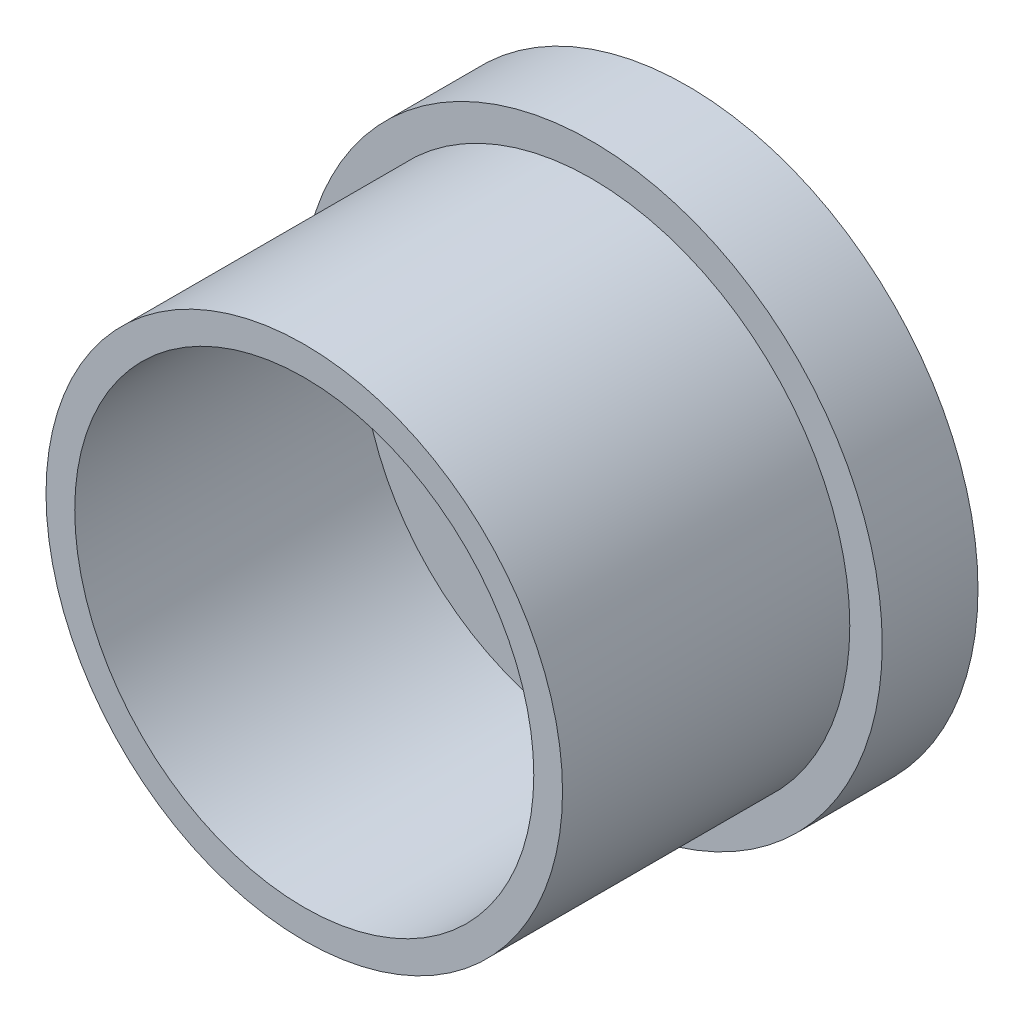
ISO-10303-21;
HEADER;
FILE_DESCRIPTION(('STEP AP214'),'2;1');
FILE_NAME('part.step','',(''),(''),'','','');
FILE_SCHEMA(('AUTOMOTIVE_DESIGN { 1 0 10303 214 1 1 1 1 }'));
ENDSEC;
DATA;
#1=APPLICATION_CONTEXT('core data for automotive mechanical design processes');
#2=APPLICATION_PROTOCOL_DEFINITION('international standard','automotive_design',2000,#1);
#3=PRODUCT_CONTEXT('',#1,'mechanical');
#4=PRODUCT('Part','Part','',(#3));
#5=PRODUCT_RELATED_PRODUCT_CATEGORY('part','',(#4));
#6=PRODUCT_DEFINITION_FORMATION('','',#4);
#7=PRODUCT_DEFINITION_CONTEXT('part definition',#1,'design');
#8=PRODUCT_DEFINITION('design','',#6,#7);
#9=PRODUCT_DEFINITION_SHAPE('','',#8);
#10=(LENGTH_UNIT() NAMED_UNIT(*) SI_UNIT(.MILLI.,.METRE.));
#11=(NAMED_UNIT(*) PLANE_ANGLE_UNIT() SI_UNIT($,.RADIAN.));
#12=(NAMED_UNIT(*) SI_UNIT($,.STERADIAN.) SOLID_ANGLE_UNIT());
#13=UNCERTAINTY_MEASURE_WITH_UNIT(LENGTH_MEASURE(1.E-05),#10,'distance_accuracy_value','');
#14=(GEOMETRIC_REPRESENTATION_CONTEXT(3) GLOBAL_UNCERTAINTY_ASSIGNED_CONTEXT((#13)) GLOBAL_UNIT_ASSIGNED_CONTEXT((#10,
#11,#12)) REPRESENTATION_CONTEXT('',''));
#15=CARTESIAN_POINT('',(0.,0.,0.));
#16=DIRECTION('',(0.,0.,1.));
#17=DIRECTION('',(1.,0.,0.));
#18=AXIS2_PLACEMENT_3D('',#15,#16,#17);
#19=CARTESIAN_POINT('',(0.,0.,10.));
#20=DIRECTION('',(0.,0.,1.));
#21=DIRECTION('',(1.,0.,0.));
#22=AXIS2_PLACEMENT_3D('',#19,#20,#21);
#23=PLANE('',#22);
#24=CARTESIAN_POINT('',(-10.5,10.5,10.));
#25=DIRECTION('',(0.,0.,1.));
#26=DIRECTION('',(1.,0.,0.));
#27=AXIS2_PLACEMENT_3D('',#24,#25,#26);
#28=CIRCLE('',#27,8.81972391336754);
#29=CARTESIAN_POINT('',(-10.5,1.68027608663247,10.));
#30=VERTEX_POINT('',#29);
#31=CARTESIAN_POINT('',(-10.5,19.3197239133675,10.));
#32=VERTEX_POINT('',#31);
#33=EDGE_CURVE('E205',#30,#32,#28,.T.);
#34=ORIENTED_EDGE('',*,*,#33,.F.);
#35=DIRECTION('',(1.,0.,0.));
#36=VECTOR('',#35,1.);
#37=CARTESIAN_POINT('',(0.,1.68027608663247,10.));
#38=LINE('',#37,#36);
#39=CARTESIAN_POINT('',(-16.75,1.68027608663247,10.));
#40=VERTEX_POINT('',#39);
#41=EDGE_CURVE('E229',#40,#30,#38,.T.);
#42=ORIENTED_EDGE('',*,*,#41,.F.);
#43=DIRECTION('',(0.,1.,0.));
#44=VECTOR('',#43,1.);
#45=CARTESIAN_POINT('',(-16.75,0.,10.));
#46=LINE('',#45,#44);
#47=CARTESIAN_POINT('',(-16.75,0.,10.));
#48=VERTEX_POINT('',#47);
#49=EDGE_CURVE('E238',#48,#40,#46,.T.);
#50=ORIENTED_EDGE('',*,*,#49,.F.);
#51=DIRECTION('',(1.,0.,0.));
#52=VECTOR('',#51,1.);
#53=CARTESIAN_POINT('',(0.,0.,10.));
#54=LINE('',#53,#52);
#55=CARTESIAN_POINT('',(-28.75,0.,10.));
#56=VERTEX_POINT('',#55);
#57=EDGE_CURVE('E242',#56,#48,#54,.T.);
#58=ORIENTED_EDGE('',*,*,#57,.F.);
#59=DIRECTION('',(0.,1.,0.));
#60=VECTOR('',#59,1.);
#61=CARTESIAN_POINT('',(-28.75,0.,10.));
#62=LINE('',#61,#60);
#63=CARTESIAN_POINT('',(-28.75,1.68027608663246,10.));
#64=VERTEX_POINT('',#63);
#65=EDGE_CURVE('E246',#56,#64,#62,.T.);
#66=ORIENTED_EDGE('',*,*,#65,.T.);
#67=CARTESIAN_POINT('',(-35.,1.68027608663246,10.));
#68=VERTEX_POINT('',#67);
#69=EDGE_CURVE('E248',#68,#64,#38,.T.);
#70=ORIENTED_EDGE('',*,*,#69,.F.);
#71=CARTESIAN_POINT('',(-35.,10.5,10.));
#72=DIRECTION('',(0.,0.,1.));
#73=DIRECTION('',(1.,0.,0.));
#74=AXIS2_PLACEMENT_3D('',#71,#72,#73);
#75=CIRCLE('',#74,8.81972391336754);
#76=CARTESIAN_POINT('',(-35.,19.3197239133675,10.));
#77=VERTEX_POINT('',#76);
#78=EDGE_CURVE('E252',#77,#68,#75,.T.);
#79=ORIENTED_EDGE('',*,*,#78,.F.);
#80=DIRECTION('',(1.,0.,0.));
#81=VECTOR('',#80,1.);
#82=CARTESIAN_POINT('',(0.,19.3197239133676,10.));
#83=LINE('',#82,#81);
#84=CARTESIAN_POINT('',(-28.3781314851122,19.3197239133675,10.));
#85=VERTEX_POINT('',#84);
#86=EDGE_CURVE('E168',#77,#85,#83,.T.);
#87=ORIENTED_EDGE('',*,*,#86,.T.);
#88=DIRECTION('',(0.,-1.,0.));
#89=VECTOR('',#88,1.);
#90=CARTESIAN_POINT('',(-28.3781314851122,0.,10.));
#91=LINE('',#90,#89);
#92=CARTESIAN_POINT('',(-28.3781314851122,21.,10.));
#93=VERTEX_POINT('',#92);
#94=EDGE_CURVE('E154',#93,#85,#91,.T.);
#95=ORIENTED_EDGE('',*,*,#94,.F.);
#96=DIRECTION('',(1.,0.,0.));
#97=VECTOR('',#96,1.);
#98=CARTESIAN_POINT('',(0.,21.,10.));
#99=LINE('',#98,#97);
#100=CARTESIAN_POINT('',(-17.074172485353,21.,10.));
#101=VERTEX_POINT('',#100);
#102=EDGE_CURVE('E148',#93,#101,#99,.T.);
#103=ORIENTED_EDGE('',*,*,#102,.T.);
#104=DIRECTION('',(0.,-1.,0.));
#105=VECTOR('',#104,1.);
#106=CARTESIAN_POINT('',(-17.074172485353,0.,10.));
#107=LINE('',#106,#105);
#108=CARTESIAN_POINT('',(-17.074172485353,19.3197239133675,10.));
#109=VERTEX_POINT('',#108);
#110=EDGE_CURVE('E152',#101,#109,#107,.T.);
#111=ORIENTED_EDGE('',*,*,#110,.T.);
#112=EDGE_CURVE('E69',#109,#32,#83,.T.);
#113=ORIENTED_EDGE('',*,*,#112,.T.);
#114=EDGE_LOOP('',(#34,#42,#50,#58,#66,#70,#79,#87,#95,#103,#111,#113));
#115=FACE_BOUND('',#114,.T.);
#116=CARTESIAN_POINT('',(-22.75,10.5,10.));
#117=DIRECTION('',(0.,0.,1.));
#118=DIRECTION('',(1.,0.,0.));
#119=AXIS2_PLACEMENT_3D('',#116,#117,#118);
#120=CIRCLE('',#119,23.9699774785851);
#121=CARTESIAN_POINT('',(1.21997747858509,10.5,10.));
#122=VERTEX_POINT('',#121);
#123=EDGE_CURVE('E266',#122,#122,#120,.T.);
#124=ORIENTED_EDGE('',*,*,#123,.T.);
#125=EDGE_LOOP('',(#124));
#126=FACE_BOUND('',#125,.T.);
#127=ADVANCED_FACE('F51',(#115,#126),#23,.T.);
#128=CARTESIAN_POINT('',(-10.5,10.5,10.));
#129=DIRECTION('',(0.,0.,-1.));
#130=DIRECTION('',(-1.,0.,0.));
#131=AXIS2_PLACEMENT_3D('',#128,#129,#130);
#132=CYLINDRICAL_SURFACE('',#131,8.81972391336754);
#133=CARTESIAN_POINT('',(-10.5,10.5,0.));
#134=DIRECTION('',(0.,0.,1.));
#135=DIRECTION('',(1.,0.,0.));
#136=AXIS2_PLACEMENT_3D('',#133,#134,#135);
#137=CIRCLE('',#136,8.81972391336754);
#138=CARTESIAN_POINT('',(-10.5,1.68027608663247,0.));
#139=VERTEX_POINT('',#138);
#140=CARTESIAN_POINT('',(-10.5,19.3197239133675,0.));
#141=VERTEX_POINT('',#140);
#142=EDGE_CURVE('E173',#139,#141,#137,.T.);
#143=ORIENTED_EDGE('',*,*,#142,.F.);
#144=DIRECTION('',(0.,0.,-1.));
#145=VECTOR('',#144,1.);
#146=CARTESIAN_POINT('',(-10.5,1.68027608663247,10.));
#147=LINE('',#146,#145);
#148=EDGE_CURVE('E55',#30,#139,#147,.T.);
#149=ORIENTED_EDGE('',*,*,#148,.F.);
#150=ORIENTED_EDGE('',*,*,#33,.T.);
#151=DIRECTION('',(0.,0.,-1.));
#152=VECTOR('',#151,1.);
#153=CARTESIAN_POINT('',(-10.5,19.3197239133675,10.));
#154=LINE('',#153,#152);
#155=EDGE_CURVE('E117',#32,#141,#154,.T.);
#156=ORIENTED_EDGE('',*,*,#155,.T.);
#157=EDGE_LOOP('',(#143,#149,#150,#156));
#158=FACE_BOUND('',#157,.T.);
#159=ADVANCED_FACE('F53',(#158),#132,.F.);
#160=CARTESIAN_POINT('',(0.,1.68027608663247,10.));
#161=DIRECTION('',(0.,1.,0.));
#162=DIRECTION('',(-1.,0.,0.));
#163=AXIS2_PLACEMENT_3D('',#160,#161,#162);
#164=PLANE('',#163);
#165=DIRECTION('',(1.,0.,0.));
#166=VECTOR('',#165,1.);
#167=CARTESIAN_POINT('',(0.,1.68027608663247,0.));
#168=LINE('',#167,#166);
#169=CARTESIAN_POINT('',(-16.75,1.68027608663247,0.));
#170=VERTEX_POINT('',#169);
#171=EDGE_CURVE('E176',#170,#139,#168,.T.);
#172=ORIENTED_EDGE('',*,*,#171,.F.);
#173=DIRECTION('',(0.,0.,-1.));
#174=VECTOR('',#173,1.);
#175=CARTESIAN_POINT('',(-16.75,1.68027608663247,10.));
#176=LINE('',#175,#174);
#177=EDGE_CURVE('E220',#40,#170,#176,.T.);
#178=ORIENTED_EDGE('',*,*,#177,.F.);
#179=ORIENTED_EDGE('',*,*,#41,.T.);
#180=ORIENTED_EDGE('',*,*,#148,.T.);
#181=EDGE_LOOP('',(#172,#178,#179,#180));
#182=FACE_BOUND('',#181,.T.);
#183=ADVANCED_FACE('F227',(#182),#164,.T.);
#184=CARTESIAN_POINT('',(-16.75,0.,10.));
#185=DIRECTION('',(-1.,0.,0.));
#186=DIRECTION('',(0.,0.,1.));
#187=AXIS2_PLACEMENT_3D('',#184,#185,#186);
#188=PLANE('',#187);
#189=DIRECTION('',(0.,1.,0.));
#190=VECTOR('',#189,1.);
#191=CARTESIAN_POINT('',(-16.75,0.,0.));
#192=LINE('',#191,#190);
#193=CARTESIAN_POINT('',(-16.75,0.,0.));
#194=VERTEX_POINT('',#193);
#195=EDGE_CURVE('E180',#194,#170,#192,.T.);
#196=ORIENTED_EDGE('',*,*,#195,.F.);
#197=DIRECTION('',(0.,0.,-1.));
#198=VECTOR('',#197,1.);
#199=CARTESIAN_POINT('',(-16.75,0.,10.));
#200=LINE('',#199,#198);
#201=EDGE_CURVE('E219',#48,#194,#200,.T.);
#202=ORIENTED_EDGE('',*,*,#201,.F.);
#203=ORIENTED_EDGE('',*,*,#49,.T.);
#204=ORIENTED_EDGE('',*,*,#177,.T.);
#205=EDGE_LOOP('',(#196,#202,#203,#204));
#206=FACE_BOUND('',#205,.T.);
#207=ADVANCED_FACE('F236',(#206),#188,.T.);
#208=CARTESIAN_POINT('',(0.,0.,10.));
#209=DIRECTION('',(0.,1.,0.));
#210=DIRECTION('',(0.,0.,1.));
#211=AXIS2_PLACEMENT_3D('',#208,#209,#210);
#212=PLANE('',#211);
#213=DIRECTION('',(1.,0.,0.));
#214=VECTOR('',#213,1.);
#215=CARTESIAN_POINT('',(0.,0.,0.));
#216=LINE('',#215,#214);
#217=CARTESIAN_POINT('',(-28.75,0.,0.));
#218=VERTEX_POINT('',#217);
#219=EDGE_CURVE('E184',#218,#194,#216,.T.);
#220=ORIENTED_EDGE('',*,*,#219,.F.);
#221=DIRECTION('',(0.,0.,-1.));
#222=VECTOR('',#221,1.);
#223=CARTESIAN_POINT('',(-28.75,0.,10.));
#224=LINE('',#223,#222);
#225=EDGE_CURVE('E217',#56,#218,#224,.T.);
#226=ORIENTED_EDGE('',*,*,#225,.F.);
#227=ORIENTED_EDGE('',*,*,#57,.T.);
#228=ORIENTED_EDGE('',*,*,#201,.T.);
#229=EDGE_LOOP('',(#220,#226,#227,#228));
#230=FACE_BOUND('',#229,.T.);
#231=ADVANCED_FACE('F244',(#230),#212,.T.);
#232=CARTESIAN_POINT('',(-28.75,0.,10.));
#233=DIRECTION('',(-1.,0.,0.));
#234=DIRECTION('',(0.,0.,1.));
#235=AXIS2_PLACEMENT_3D('',#232,#233,#234);
#236=PLANE('',#235);
#237=DIRECTION('',(0.,1.,0.));
#238=VECTOR('',#237,1.);
#239=CARTESIAN_POINT('',(-28.75,0.,0.));
#240=LINE('',#239,#238);
#241=CARTESIAN_POINT('',(-28.75,1.68027608663246,0.));
#242=VERTEX_POINT('',#241);
#243=EDGE_CURVE('E187',#218,#242,#240,.T.);
#244=ORIENTED_EDGE('',*,*,#243,.T.);
#245=DIRECTION('',(0.,0.,-1.));
#246=VECTOR('',#245,1.);
#247=CARTESIAN_POINT('',(-28.75,1.68027608663246,10.));
#248=LINE('',#247,#246);
#249=EDGE_CURVE('E215',#64,#242,#248,.T.);
#250=ORIENTED_EDGE('',*,*,#249,.F.);
#251=ORIENTED_EDGE('',*,*,#65,.F.);
#252=ORIENTED_EDGE('',*,*,#225,.T.);
#253=EDGE_LOOP('',(#244,#250,#251,#252));
#254=FACE_BOUND('',#253,.T.);
#255=ADVANCED_FACE('F327',(#254),#236,.F.);
#256=CARTESIAN_POINT('',(-35.,1.68027608663246,0.));
#257=VERTEX_POINT('',#256);
#258=EDGE_CURVE('E181',#257,#242,#168,.T.);
#259=ORIENTED_EDGE('',*,*,#258,.F.);
#260=DIRECTION('',(0.,0.,-1.));
#261=VECTOR('',#260,1.);
#262=CARTESIAN_POINT('',(-35.,1.68027608663246,10.));
#263=LINE('',#262,#261);
#264=EDGE_CURVE('E213',#68,#257,#263,.T.);
#265=ORIENTED_EDGE('',*,*,#264,.F.);
#266=ORIENTED_EDGE('',*,*,#69,.T.);
#267=ORIENTED_EDGE('',*,*,#249,.T.);
#268=EDGE_LOOP('',(#259,#265,#266,#267));
#269=FACE_BOUND('',#268,.T.);
#270=ADVANCED_FACE('F323',(#269),#164,.T.);
#271=CARTESIAN_POINT('',(-35.,10.5,10.));
#272=DIRECTION('',(0.,0.,-1.));
#273=DIRECTION('',(-1.,0.,0.));
#274=AXIS2_PLACEMENT_3D('',#271,#272,#273);
#275=CYLINDRICAL_SURFACE('',#274,8.81972391336754);
#276=CARTESIAN_POINT('',(-35.,10.5,0.));
#277=DIRECTION('',(0.,0.,1.));
#278=DIRECTION('',(1.,0.,0.));
#279=AXIS2_PLACEMENT_3D('',#276,#277,#278);
#280=CIRCLE('',#279,8.81972391336754);
#281=CARTESIAN_POINT('',(-35.,19.3197239133675,0.));
#282=VERTEX_POINT('',#281);
#283=EDGE_CURVE('E190',#282,#257,#280,.T.);
#284=ORIENTED_EDGE('',*,*,#283,.F.);
#285=DIRECTION('',(0.,0.,-1.));
#286=VECTOR('',#285,1.);
#287=CARTESIAN_POINT('',(-35.,19.3197239133675,10.));
#288=LINE('',#287,#286);
#289=EDGE_CURVE('E211',#77,#282,#288,.T.);
#290=ORIENTED_EDGE('',*,*,#289,.F.);
#291=ORIENTED_EDGE('',*,*,#78,.T.);
#292=ORIENTED_EDGE('',*,*,#264,.T.);
#293=EDGE_LOOP('',(#284,#290,#291,#292));
#294=FACE_BOUND('',#293,.T.);
#295=ADVANCED_FACE('F320',(#294),#275,.F.);
#296=CARTESIAN_POINT('',(0.,19.3197239133676,10.));
#297=DIRECTION('',(0.,1.,0.));
#298=DIRECTION('',(-1.,0.,0.));
#299=AXIS2_PLACEMENT_3D('',#296,#297,#298);
#300=PLANE('',#299);
#301=DIRECTION('',(1.,0.,0.));
#302=VECTOR('',#301,1.);
#303=CARTESIAN_POINT('',(0.,19.3197239133676,0.));
#304=LINE('',#303,#302);
#305=CARTESIAN_POINT('',(-28.3781314851122,19.3197239133675,0.));
#306=VERTEX_POINT('',#305);
#307=EDGE_CURVE('E193',#282,#306,#304,.T.);
#308=ORIENTED_EDGE('',*,*,#307,.T.);
#309=DIRECTION('',(0.,0.,-1.));
#310=VECTOR('',#309,1.);
#311=CARTESIAN_POINT('',(-28.3781314851122,19.3197239133675,10.));
#312=LINE('',#311,#310);
#313=EDGE_CURVE('E209',#85,#306,#312,.T.);
#314=ORIENTED_EDGE('',*,*,#313,.F.);
#315=ORIENTED_EDGE('',*,*,#86,.F.);
#316=ORIENTED_EDGE('',*,*,#289,.T.);
#317=EDGE_LOOP('',(#308,#314,#315,#316));
#318=FACE_BOUND('',#317,.T.);
#319=ADVANCED_FACE('F312',(#318),#300,.F.);
#320=CARTESIAN_POINT('',(-28.3781314851122,0.,10.));
#321=DIRECTION('',(1.,0.,0.));
#322=DIRECTION('',(0.,0.,-1.));
#323=AXIS2_PLACEMENT_3D('',#320,#321,#322);
#324=PLANE('',#323);
#325=DIRECTION('',(0.,-1.,0.));
#326=VECTOR('',#325,1.);
#327=CARTESIAN_POINT('',(-28.3781314851122,0.,0.));
#328=LINE('',#327,#326);
#329=CARTESIAN_POINT('',(-28.3781314851122,21.,0.));
#330=VERTEX_POINT('',#329);
#331=EDGE_CURVE('E196',#330,#306,#328,.T.);
#332=ORIENTED_EDGE('',*,*,#331,.F.);
#333=DIRECTION('',(0.,0.,-1.));
#334=VECTOR('',#333,1.);
#335=CARTESIAN_POINT('',(-28.3781314851122,21.,10.));
#336=LINE('',#335,#334);
#337=EDGE_CURVE('E161',#93,#330,#336,.T.);
#338=ORIENTED_EDGE('',*,*,#337,.F.);
#339=ORIENTED_EDGE('',*,*,#94,.T.);
#340=ORIENTED_EDGE('',*,*,#313,.T.);
#341=EDGE_LOOP('',(#332,#338,#339,#340));
#342=FACE_BOUND('',#341,.T.);
#343=ADVANCED_FACE('F256',(#342),#324,.T.);
#344=CARTESIAN_POINT('',(0.,21.,10.));
#345=DIRECTION('',(0.,1.,0.));
#346=DIRECTION('',(0.,0.,1.));
#347=AXIS2_PLACEMENT_3D('',#344,#345,#346);
#348=PLANE('',#347);
#349=DIRECTION('',(1.,0.,0.));
#350=VECTOR('',#349,1.);
#351=CARTESIAN_POINT('',(0.,21.,0.));
#352=LINE('',#351,#350);
#353=CARTESIAN_POINT('',(-17.074172485353,21.,0.));
#354=VERTEX_POINT('',#353);
#355=EDGE_CURVE('E160',#330,#354,#352,.T.);
#356=ORIENTED_EDGE('',*,*,#355,.T.);
#357=DIRECTION('',(0.,0.,-1.));
#358=VECTOR('',#357,1.);
#359=CARTESIAN_POINT('',(-17.074172485353,21.,10.));
#360=LINE('',#359,#358);
#361=EDGE_CURVE('E157',#101,#354,#360,.T.);
#362=ORIENTED_EDGE('',*,*,#361,.F.);
#363=ORIENTED_EDGE('',*,*,#102,.F.);
#364=ORIENTED_EDGE('',*,*,#337,.T.);
#365=EDGE_LOOP('',(#356,#362,#363,#364));
#366=FACE_BOUND('',#365,.T.);
#367=ADVANCED_FACE('F158',(#366),#348,.F.);
#368=CARTESIAN_POINT('',(-17.074172485353,0.,10.));
#369=DIRECTION('',(1.,0.,0.));
#370=DIRECTION('',(0.,0.,-1.));
#371=AXIS2_PLACEMENT_3D('',#368,#369,#370);
#372=PLANE('',#371);
#373=DIRECTION('',(0.,-1.,0.));
#374=VECTOR('',#373,1.);
#375=CARTESIAN_POINT('',(-17.074172485353,0.,0.));
#376=LINE('',#375,#374);
#377=CARTESIAN_POINT('',(-17.074172485353,19.3197239133675,0.));
#378=VERTEX_POINT('',#377);
#379=EDGE_CURVE('E110',#354,#378,#376,.T.);
#380=ORIENTED_EDGE('',*,*,#379,.T.);
#381=DIRECTION('',(0.,0.,-1.));
#382=VECTOR('',#381,1.);
#383=CARTESIAN_POINT('',(-17.074172485353,19.3197239133675,10.));
#384=LINE('',#383,#382);
#385=EDGE_CURVE('E162',#109,#378,#384,.T.);
#386=ORIENTED_EDGE('',*,*,#385,.F.);
#387=ORIENTED_EDGE('',*,*,#110,.F.);
#388=ORIENTED_EDGE('',*,*,#361,.T.);
#389=EDGE_LOOP('',(#380,#386,#387,#388));
#390=FACE_BOUND('',#389,.T.);
#391=ADVANCED_FACE('F164',(#390),#372,.F.);
#392=EDGE_CURVE('E197',#378,#141,#304,.T.);
#393=ORIENTED_EDGE('',*,*,#392,.T.);
#394=ORIENTED_EDGE('',*,*,#155,.F.);
#395=ORIENTED_EDGE('',*,*,#112,.F.);
#396=ORIENTED_EDGE('',*,*,#385,.T.);
#397=EDGE_LOOP('',(#393,#394,#395,#396));
#398=FACE_BOUND('',#397,.T.);
#399=ADVANCED_FACE('F260',(#398),#300,.F.);
#400=CARTESIAN_POINT('',(-22.75,10.5,10.));
#401=DIRECTION('',(0.,0.,-1.));
#402=DIRECTION('',(-1.,0.,0.));
#403=AXIS2_PLACEMENT_3D('',#400,#401,#402);
#404=CYLINDRICAL_SURFACE('',#403,30.3583513567899);
#405=CARTESIAN_POINT('',(-22.75,10.5,10.));
#406=DIRECTION('',(0.,0.,1.));
#407=DIRECTION('',(1.,0.,0.));
#408=AXIS2_PLACEMENT_3D('',#405,#406,#407);
#409=CIRCLE('',#408,30.3583513567899);
#410=CARTESIAN_POINT('',(7.60835135678991,10.5,10.));
#411=VERTEX_POINT('',#410);
#412=EDGE_CURVE('E166',#411,#411,#409,.T.);
#413=ORIENTED_EDGE('',*,*,#412,.F.);
#414=EDGE_LOOP('',(#413));
#415=FACE_BOUND('',#414,.T.);
#416=CARTESIAN_POINT('',(-22.75,10.5,0.));
#417=DIRECTION('',(0.,0.,1.));
#418=DIRECTION('',(1.,0.,0.));
#419=AXIS2_PLACEMENT_3D('',#416,#417,#418);
#420=CIRCLE('',#419,30.3583513567899);
#421=CARTESIAN_POINT('',(7.60835135678991,10.5,0.));
#422=VERTEX_POINT('',#421);
#423=EDGE_CURVE('E202',#422,#422,#420,.T.);
#424=ORIENTED_EDGE('',*,*,#423,.T.);
#425=EDGE_LOOP('',(#424));
#426=FACE_BOUND('',#425,.T.);
#427=ADVANCED_FACE('F295',(#415,#426),#404,.T.);
#428=CARTESIAN_POINT('',(-22.75,10.5,10.));
#429=DIRECTION('',(0.,0.,1.));
#430=DIRECTION('',(1.,0.,0.));
#431=AXIS2_PLACEMENT_3D('',#428,#429,#430);
#432=CIRCLE('',#431,26.9699774785851);
#433=CARTESIAN_POINT('',(4.21997747858509,10.5,10.));
#434=VERTEX_POINT('',#433);
#435=EDGE_CURVE('E14',#434,#434,#432,.T.);
#436=ORIENTED_EDGE('',*,*,#435,.F.);
#437=EDGE_LOOP('',(#436));
#438=FACE_BOUND('',#437,.T.);
#439=ORIENTED_EDGE('',*,*,#412,.T.);
#440=EDGE_LOOP('',(#439));
#441=FACE_BOUND('',#440,.T.);
#442=ADVANCED_FACE('F286',(#438,#441),#23,.T.);
#443=CARTESIAN_POINT('',(0.,0.,0.));
#444=DIRECTION('',(0.,0.,1.));
#445=DIRECTION('',(1.,0.,0.));
#446=AXIS2_PLACEMENT_3D('',#443,#444,#445);
#447=PLANE('',#446);
#448=ORIENTED_EDGE('',*,*,#142,.T.);
#449=ORIENTED_EDGE('',*,*,#392,.F.);
#450=ORIENTED_EDGE('',*,*,#379,.F.);
#451=ORIENTED_EDGE('',*,*,#355,.F.);
#452=ORIENTED_EDGE('',*,*,#331,.T.);
#453=ORIENTED_EDGE('',*,*,#307,.F.);
#454=ORIENTED_EDGE('',*,*,#283,.T.);
#455=ORIENTED_EDGE('',*,*,#258,.T.);
#456=ORIENTED_EDGE('',*,*,#243,.F.);
#457=ORIENTED_EDGE('',*,*,#219,.T.);
#458=ORIENTED_EDGE('',*,*,#195,.T.);
#459=ORIENTED_EDGE('',*,*,#171,.T.);
#460=EDGE_LOOP('',(#448,#449,#450,#451,#452,#453,#454,#455,#456,#457,#458,#459));
#461=FACE_BOUND('',#460,.T.);
#462=ORIENTED_EDGE('',*,*,#423,.F.);
#463=EDGE_LOOP('',(#462));
#464=FACE_BOUND('',#463,.T.);
#465=ADVANCED_FACE('F232',(#461,#464),#447,.F.);
#466=CARTESIAN_POINT('',(-22.75,10.5,40.));
#467=DIRECTION('',(0.,0.,1.));
#468=DIRECTION('',(1.,0.,0.));
#469=AXIS2_PLACEMENT_3D('',#466,#467,#468);
#470=PLANE('',#469);
#471=CARTESIAN_POINT('',(-22.75,10.5,40.));
#472=DIRECTION('',(0.,0.,1.));
#473=DIRECTION('',(1.,0.,0.));
#474=AXIS2_PLACEMENT_3D('',#471,#472,#473);
#475=CIRCLE('',#474,26.9699774785851);
#476=CARTESIAN_POINT('',(4.21997747858509,10.5,40.));
#477=VERTEX_POINT('',#476);
#478=EDGE_CURVE('E177',#477,#477,#475,.T.);
#479=ORIENTED_EDGE('',*,*,#478,.T.);
#480=EDGE_LOOP('',(#479));
#481=FACE_BOUND('',#480,.T.);
#482=CARTESIAN_POINT('',(-22.75,10.5,40.));
#483=DIRECTION('',(0.,0.,1.));
#484=DIRECTION('',(1.,0.,0.));
#485=AXIS2_PLACEMENT_3D('',#482,#483,#484);
#486=CIRCLE('',#485,23.9699774785851);
#487=CARTESIAN_POINT('',(1.21997747858509,10.5,40.));
#488=VERTEX_POINT('',#487);
#489=EDGE_CURVE('E265',#488,#488,#486,.T.);
#490=ORIENTED_EDGE('',*,*,#489,.F.);
#491=EDGE_LOOP('',(#490));
#492=FACE_BOUND('',#491,.T.);
#493=ADVANCED_FACE('F275',(#481,#492),#470,.T.);
#494=CARTESIAN_POINT('',(-22.75,10.5,40.));
#495=DIRECTION('',(0.,0.,-1.));
#496=DIRECTION('',(-1.,0.,0.));
#497=AXIS2_PLACEMENT_3D('',#494,#495,#496);
#498=CYLINDRICAL_SURFACE('',#497,26.9699774785851);
#499=ORIENTED_EDGE('',*,*,#478,.F.);
#500=EDGE_LOOP('',(#499));
#501=FACE_BOUND('',#500,.T.);
#502=ORIENTED_EDGE('',*,*,#435,.T.);
#503=EDGE_LOOP('',(#502));
#504=FACE_BOUND('',#503,.T.);
#505=ADVANCED_FACE('F277',(#501,#504),#498,.T.);
#506=CARTESIAN_POINT('',(-22.75,10.5,40.));
#507=DIRECTION('',(0.,0.,-1.));
#508=DIRECTION('',(-1.,0.,0.));
#509=AXIS2_PLACEMENT_3D('',#506,#507,#508);
#510=CYLINDRICAL_SURFACE('',#509,23.9699774785851);
#511=ORIENTED_EDGE('',*,*,#489,.T.);
#512=EDGE_LOOP('',(#511));
#513=FACE_BOUND('',#512,.T.);
#514=ORIENTED_EDGE('',*,*,#123,.F.);
#515=EDGE_LOOP('',(#514));
#516=FACE_BOUND('',#515,.T.);
#517=ADVANCED_FACE('F272',(#513,#516),#510,.F.);
#518=CLOSED_SHELL('',(#127,#159,#183,#207,#231,#255,#270,#295,#319,#343,#367,#391,#399,#427,
#442,#465,#493,#505,#517));
#519=MANIFOLD_SOLID_BREP('B2',#518);
#520=ADVANCED_BREP_SHAPE_REPRESENTATION('',(#18,#519),#14);
#521=SHAPE_DEFINITION_REPRESENTATION(#9,#520);
ENDSEC;
END-ISO-10303-21;
